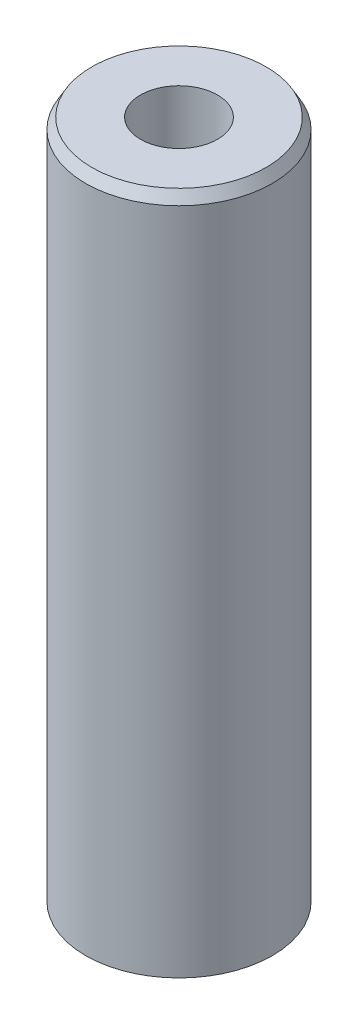
ISO-10303-21;
HEADER;
FILE_DESCRIPTION(('STEP AP214'),'2;1');
FILE_NAME('part.step','',(''),(''),'','','');
FILE_SCHEMA(('AUTOMOTIVE_DESIGN { 1 0 10303 214 1 1 1 1 }'));
ENDSEC;
DATA;
#1=APPLICATION_CONTEXT('core data for automotive mechanical design processes');
#2=APPLICATION_PROTOCOL_DEFINITION('international standard','automotive_design',2000,#1);
#3=PRODUCT_CONTEXT('',#1,'mechanical');
#4=PRODUCT('Part','Part','',(#3));
#5=PRODUCT_RELATED_PRODUCT_CATEGORY('part','',(#4));
#6=PRODUCT_DEFINITION_FORMATION('','',#4);
#7=PRODUCT_DEFINITION_CONTEXT('part definition',#1,'design');
#8=PRODUCT_DEFINITION('design','',#6,#7);
#9=PRODUCT_DEFINITION_SHAPE('','',#8);
#10=(LENGTH_UNIT() NAMED_UNIT(*) SI_UNIT(.MILLI.,.METRE.));
#11=(NAMED_UNIT(*) PLANE_ANGLE_UNIT() SI_UNIT($,.RADIAN.));
#12=(NAMED_UNIT(*) SI_UNIT($,.STERADIAN.) SOLID_ANGLE_UNIT());
#13=UNCERTAINTY_MEASURE_WITH_UNIT(LENGTH_MEASURE(1.E-05),#10,'distance_accuracy_value','');
#14=(GEOMETRIC_REPRESENTATION_CONTEXT(3) GLOBAL_UNCERTAINTY_ASSIGNED_CONTEXT((#13)) GLOBAL_UNIT_ASSIGNED_CONTEXT((#10,
#11,#12)) REPRESENTATION_CONTEXT('',''));
#15=CARTESIAN_POINT('',(0.,0.,0.));
#16=DIRECTION('',(0.,0.,1.));
#17=DIRECTION('',(1.,0.,0.));
#18=AXIS2_PLACEMENT_3D('',#15,#16,#17);
#19=CARTESIAN_POINT('',(0.,348.75570729971,0.));
#20=DIRECTION('',(0.,-1.,0.));
#21=DIRECTION('',(0.,0.,-1.));
#22=AXIS2_PLACEMENT_3D('',#19,#20,#21);
#23=CYLINDRICAL_SURFACE('',#22,47.5);
#24=CARTESIAN_POINT('',(0.,343.294916900016,0.));
#25=DIRECTION('',(0.,1.,0.));
#26=DIRECTION('',(0.,0.,1.));
#27=AXIS2_PLACEMENT_3D('',#24,#25,#26);
#28=CIRCLE('',#27,47.5);
#29=CARTESIAN_POINT('',(0.,343.294916900016,47.5));
#30=VERTEX_POINT('',#29);
#31=EDGE_CURVE('E50',#30,#30,#28,.F.);
#32=ORIENTED_EDGE('',*,*,#31,.T.);
#33=EDGE_LOOP('',(#32));
#34=FACE_BOUND('',#33,.T.);
#35=CARTESIAN_POINT('',(0.,3.15278880725167,0.));
#36=DIRECTION('',(0.,1.,0.));
#37=DIRECTION('',(0.,0.,1.));
#38=AXIS2_PLACEMENT_3D('',#35,#36,#37);
#39=CIRCLE('',#38,47.5);
#40=CARTESIAN_POINT('',(0.,3.15278880725167,47.5));
#41=VERTEX_POINT('',#40);
#42=EDGE_CURVE('E51',#41,#41,#39,.T.);
#43=ORIENTED_EDGE('',*,*,#42,.T.);
#44=EDGE_LOOP('',(#43));
#45=FACE_BOUND('',#44,.T.);
#46=ADVANCED_FACE('F39',(#34,#45),#23,.T.);
#47=CARTESIAN_POINT('',(0.,348.75570729971,0.));
#48=DIRECTION('',(0.,1.,0.));
#49=DIRECTION('',(0.,0.,1.));
#50=AXIS2_PLACEMENT_3D('',#47,#48,#49);
#51=PLANE('',#50);
#52=CARTESIAN_POINT('',(0.,348.75570729971,0.));
#53=DIRECTION('',(0.,1.,0.));
#54=DIRECTION('',(0.,0.,1.));
#55=AXIS2_PLACEMENT_3D('',#52,#53,#54);
#56=CIRCLE('',#55,44.3472111927483);
#57=CARTESIAN_POINT('',(0.,348.75570729971,44.3472111927483));
#58=VERTEX_POINT('',#57);
#59=EDGE_CURVE('E54',#58,#58,#56,.T.);
#60=ORIENTED_EDGE('',*,*,#59,.T.);
#61=EDGE_LOOP('',(#60));
#62=FACE_BOUND('',#61,.T.);
#63=CARTESIAN_POINT('',(0.,348.75570729971,0.));
#64=DIRECTION('',(0.,1.,0.));
#65=DIRECTION('',(0.,0.,1.));
#66=AXIS2_PLACEMENT_3D('',#63,#64,#65);
#67=CIRCLE('',#66,19.5745510420759);
#68=CARTESIAN_POINT('',(0.,348.75570729971,19.5745510420759));
#69=VERTEX_POINT('',#68);
#70=EDGE_CURVE('E58',#69,#69,#67,.T.);
#71=ORIENTED_EDGE('',*,*,#70,.F.);
#72=EDGE_LOOP('',(#71));
#73=FACE_BOUND('',#72,.T.);
#74=ADVANCED_FACE('F69',(#62,#73),#51,.T.);
#75=CARTESIAN_POINT('',(0.,0.,0.));
#76=DIRECTION('',(0.,1.,0.));
#77=DIRECTION('',(0.,0.,1.));
#78=AXIS2_PLACEMENT_3D('',#75,#76,#77);
#79=PLANE('',#78);
#80=CARTESIAN_POINT('',(0.,0.,0.));
#81=DIRECTION('',(0.,1.,0.));
#82=DIRECTION('',(0.,0.,1.));
#83=AXIS2_PLACEMENT_3D('',#80,#81,#82);
#84=CIRCLE('',#83,42.0392096003056);
#85=CARTESIAN_POINT('',(0.,0.,42.0392096003056));
#86=VERTEX_POINT('',#85);
#87=EDGE_CURVE('E10',#86,#86,#84,.F.);
#88=ORIENTED_EDGE('',*,*,#87,.T.);
#89=EDGE_LOOP('',(#88));
#90=FACE_BOUND('',#89,.T.);
#91=CARTESIAN_POINT('',(0.,0.,0.));
#92=DIRECTION('',(0.,1.,0.));
#93=DIRECTION('',(0.,0.,1.));
#94=AXIS2_PLACEMENT_3D('',#91,#92,#93);
#95=CIRCLE('',#94,19.5745510420759);
#96=CARTESIAN_POINT('',(0.,0.,19.5745510420759));
#97=VERTEX_POINT('',#96);
#98=EDGE_CURVE('E63',#97,#97,#95,.T.);
#99=ORIENTED_EDGE('',*,*,#98,.T.);
#100=EDGE_LOOP('',(#99));
#101=FACE_BOUND('',#100,.T.);
#102=ADVANCED_FACE('F75',(#90,#101),#79,.F.);
#103=CARTESIAN_POINT('',(0.,348.75570729971,0.));
#104=DIRECTION('',(0.,-1.,0.));
#105=DIRECTION('',(0.,0.,-1.));
#106=AXIS2_PLACEMENT_3D('',#103,#104,#105);
#107=CYLINDRICAL_SURFACE('',#106,19.5745510420759);
#108=ORIENTED_EDGE('',*,*,#70,.T.);
#109=EDGE_LOOP('',(#108));
#110=FACE_BOUND('',#109,.T.);
#111=ORIENTED_EDGE('',*,*,#98,.F.);
#112=EDGE_LOOP('',(#111));
#113=FACE_BOUND('',#112,.T.);
#114=ADVANCED_FACE('F70',(#110,#113),#107,.F.);
#115=CARTESIAN_POINT('',(0.,348.75570729971,0.));
#116=DIRECTION('',(0.,-1.,0.));
#117=DIRECTION('',(0.,0.,-1.));
#118=AXIS2_PLACEMENT_3D('',#115,#116,#117);
#119=CONICAL_SURFACE('',#118,44.3472111927483,0.523598775598293);
#120=ORIENTED_EDGE('',*,*,#31,.F.);
#121=EDGE_LOOP('',(#120));
#122=FACE_BOUND('',#121,.T.);
#123=ORIENTED_EDGE('',*,*,#59,.F.);
#124=EDGE_LOOP('',(#123));
#125=FACE_BOUND('',#124,.T.);
#126=ADVANCED_FACE('F81',(#122,#125),#119,.T.);
#127=CARTESIAN_POINT('',(0.,3.15278880725167,0.));
#128=DIRECTION('',(0.,1.,0.));
#129=DIRECTION('',(0.,0.,1.));
#130=AXIS2_PLACEMENT_3D('',#127,#128,#129);
#131=CONICAL_SURFACE('',#130,47.5,1.0471975511966);
#132=ORIENTED_EDGE('',*,*,#87,.F.);
#133=EDGE_LOOP('',(#132));
#134=FACE_BOUND('',#133,.T.);
#135=ORIENTED_EDGE('',*,*,#42,.F.);
#136=EDGE_LOOP('',(#135));
#137=FACE_BOUND('',#136,.T.);
#138=ADVANCED_FACE('F45',(#134,#137),#131,.T.);
#139=CLOSED_SHELL('',(#46,#74,#102,#114,#126,#138));
#140=MANIFOLD_SOLID_BREP('B2',#139);
#141=ADVANCED_BREP_SHAPE_REPRESENTATION('',(#18,#140),#14);
#142=SHAPE_DEFINITION_REPRESENTATION(#9,#141);
ENDSEC;
END-ISO-10303-21;
